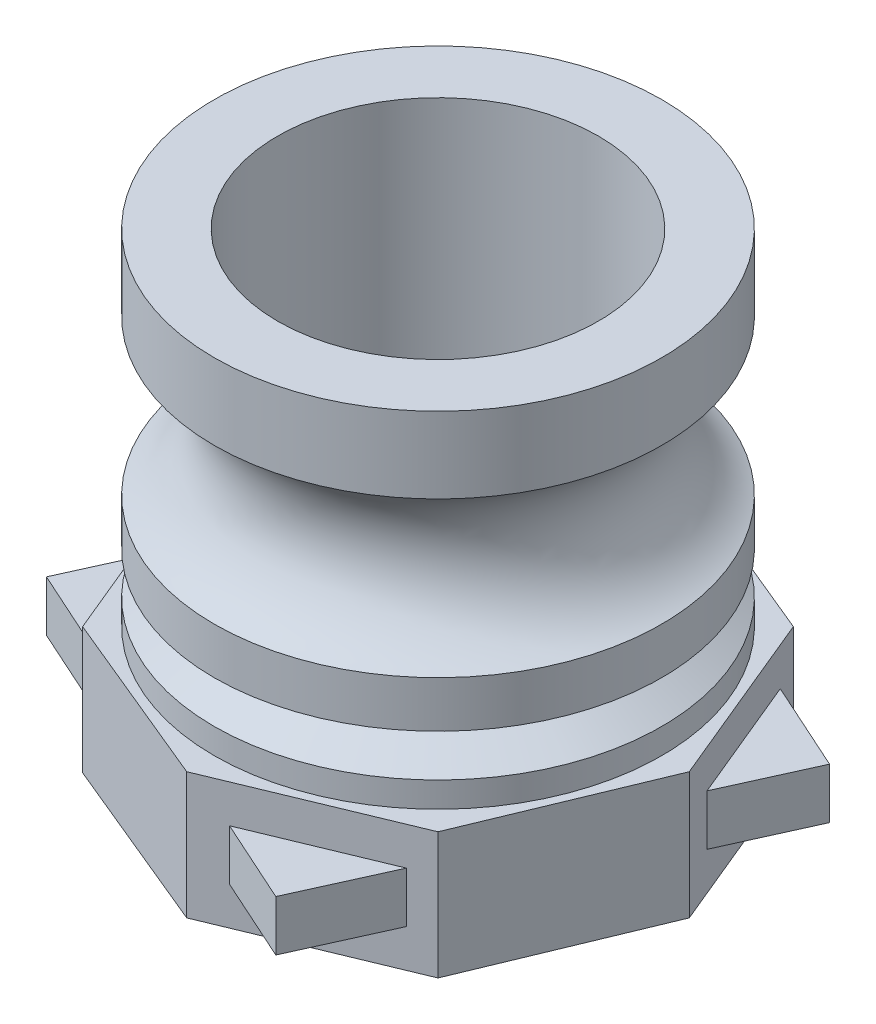
ISO-10303-21;
HEADER;
FILE_DESCRIPTION(('STEP AP214'),'2;1');
FILE_NAME('part.step','',(''),(''),'','','');
FILE_SCHEMA(('AUTOMOTIVE_DESIGN { 1 0 10303 214 1 1 1 1 }'));
ENDSEC;
DATA;
#1=APPLICATION_CONTEXT('core data for automotive mechanical design processes');
#2=APPLICATION_PROTOCOL_DEFINITION('international standard','automotive_design',2000,#1);
#3=PRODUCT_CONTEXT('',#1,'mechanical');
#4=PRODUCT('Part','Part','',(#3));
#5=PRODUCT_RELATED_PRODUCT_CATEGORY('part','',(#4));
#6=PRODUCT_DEFINITION_FORMATION('','',#4);
#7=PRODUCT_DEFINITION_CONTEXT('part definition',#1,'design');
#8=PRODUCT_DEFINITION('design','',#6,#7);
#9=PRODUCT_DEFINITION_SHAPE('','',#8);
#10=(LENGTH_UNIT() NAMED_UNIT(*) SI_UNIT(.MILLI.,.METRE.));
#11=(NAMED_UNIT(*) PLANE_ANGLE_UNIT() SI_UNIT($,.RADIAN.));
#12=(NAMED_UNIT(*) SI_UNIT($,.STERADIAN.) SOLID_ANGLE_UNIT());
#13=UNCERTAINTY_MEASURE_WITH_UNIT(LENGTH_MEASURE(1.E-05),#10,'distance_accuracy_value','');
#14=(GEOMETRIC_REPRESENTATION_CONTEXT(3) GLOBAL_UNCERTAINTY_ASSIGNED_CONTEXT((#13)) GLOBAL_UNIT_ASSIGNED_CONTEXT((#10,
#11,#12)) REPRESENTATION_CONTEXT('',''));
#15=CARTESIAN_POINT('',(0.,0.,0.));
#16=DIRECTION('',(0.,0.,1.));
#17=DIRECTION('',(1.,0.,0.));
#18=AXIS2_PLACEMENT_3D('',#15,#16,#17);
#19=CARTESIAN_POINT('',(0.,102.251774253954,0.));
#20=DIRECTION('',(0.,1.,0.));
#21=DIRECTION('',(0.,0.,1.));
#22=AXIS2_PLACEMENT_3D('',#19,#20,#21);
#23=CYLINDRICAL_SURFACE('',#22,26.5);
#24=CARTESIAN_POINT('',(0.,23.,0.));
#25=DIRECTION('',(0.,-1.,0.));
#26=DIRECTION('',(0.,0.,-1.));
#27=AXIS2_PLACEMENT_3D('',#24,#25,#26);
#28=CIRCLE('',#27,26.5);
#29=CARTESIAN_POINT('',(0.,23.,-26.5));
#30=VERTEX_POINT('',#29);
#31=EDGE_CURVE('E257',#30,#30,#28,.T.);
#32=ORIENTED_EDGE('',*,*,#31,.F.);
#33=EDGE_LOOP('',(#32));
#34=FACE_BOUND('',#33,.T.);
#35=CARTESIAN_POINT('',(0.,28.5,0.));
#36=DIRECTION('',(0.,1.,0.));
#37=DIRECTION('',(0.,0.,1.));
#38=AXIS2_PLACEMENT_3D('',#35,#36,#37);
#39=CIRCLE('',#38,26.5);
#40=CARTESIAN_POINT('',(0.,28.5,26.5));
#41=VERTEX_POINT('',#40);
#42=EDGE_CURVE('E284',#41,#41,#39,.T.);
#43=ORIENTED_EDGE('',*,*,#42,.F.);
#44=EDGE_LOOP('',(#43));
#45=FACE_BOUND('',#44,.T.);
#46=ADVANCED_FACE('F41',(#34,#45),#23,.T.);
#47=CARTESIAN_POINT('',(0.,15.,0.));
#48=DIRECTION('',(0.,1.,0.));
#49=DIRECTION('',(0.,0.,1.));
#50=AXIS2_PLACEMENT_3D('',#47,#48,#49);
#51=PLANE('',#50);
#52=CARTESIAN_POINT('',(0.,15.,0.));
#53=DIRECTION('',(0.,1.,0.));
#54=DIRECTION('',(0.,0.,1.));
#55=AXIS2_PLACEMENT_3D('',#52,#53,#54);
#56=CIRCLE('',#55,26.5);
#57=CARTESIAN_POINT('',(0.,15.,26.5));
#58=VERTEX_POINT('',#57);
#59=EDGE_CURVE('E11',#58,#58,#56,.T.);
#60=ORIENTED_EDGE('',*,*,#59,.F.);
#61=EDGE_LOOP('',(#60));
#62=FACE_BOUND('',#61,.T.);
#63=DIRECTION('',(-0.382683432365091,0.,-0.923879532511286));
#64=VECTOR('',#63,1.);
#65=CARTESIAN_POINT('',(29.7657855080408,15.,0.));
#66=LINE('',#65,#64);
#67=CARTESIAN_POINT('',(29.7657855080408,15.,0.));
#68=VERTEX_POINT('',#67);
#69=CARTESIAN_POINT('',(21.0475887800799,15.,-21.04758878008));
#70=VERTEX_POINT('',#69);
#71=EDGE_CURVE('E297',#68,#70,#66,.T.);
#72=ORIENTED_EDGE('',*,*,#71,.T.);
#73=DIRECTION('',(-0.923879532511287,0.,-0.382683432365089));
#74=VECTOR('',#73,1.);
#75=CARTESIAN_POINT('',(21.0475887800799,15.,-21.04758878008));
#76=LINE('',#75,#74);
#77=CARTESIAN_POINT('',(0.,15.,-29.7657855080408));
#78=VERTEX_POINT('',#77);
#79=EDGE_CURVE('E300',#70,#78,#76,.T.);
#80=ORIENTED_EDGE('',*,*,#79,.T.);
#81=DIRECTION('',(-0.923879532511286,0.,0.382683432365091));
#82=VECTOR('',#81,1.);
#83=CARTESIAN_POINT('',(0.,15.,-29.7657855080408));
#84=LINE('',#83,#82);
#85=CARTESIAN_POINT('',(-21.04758878008,15.,-21.0475887800799));
#86=VERTEX_POINT('',#85);
#87=EDGE_CURVE('E303',#78,#86,#84,.T.);
#88=ORIENTED_EDGE('',*,*,#87,.T.);
#89=DIRECTION('',(-0.382683432365089,0.,0.923879532511287));
#90=VECTOR('',#89,1.);
#91=CARTESIAN_POINT('',(-21.04758878008,15.,-21.0475887800799));
#92=LINE('',#91,#90);
#93=CARTESIAN_POINT('',(-29.7657855080408,15.,0.));
#94=VERTEX_POINT('',#93);
#95=EDGE_CURVE('E305',#86,#94,#92,.T.);
#96=ORIENTED_EDGE('',*,*,#95,.T.);
#97=DIRECTION('',(0.382683432365091,0.,0.923879532511287));
#98=VECTOR('',#97,1.);
#99=CARTESIAN_POINT('',(-29.7657855080408,15.,0.));
#100=LINE('',#99,#98);
#101=CARTESIAN_POINT('',(-21.0475887800799,15.,21.04758878008));
#102=VERTEX_POINT('',#101);
#103=EDGE_CURVE('E307',#94,#102,#100,.T.);
#104=ORIENTED_EDGE('',*,*,#103,.T.);
#105=DIRECTION('',(0.923879532511287,0.,0.382683432365089));
#106=VECTOR('',#105,1.);
#107=CARTESIAN_POINT('',(-21.0475887800799,15.,21.04758878008));
#108=LINE('',#107,#106);
#109=CARTESIAN_POINT('',(0.,15.,29.7657855080408));
#110=VERTEX_POINT('',#109);
#111=EDGE_CURVE('E309',#102,#110,#108,.T.);
#112=ORIENTED_EDGE('',*,*,#111,.T.);
#113=DIRECTION('',(0.923879532511286,0.,-0.382683432365091));
#114=VECTOR('',#113,1.);
#115=CARTESIAN_POINT('',(0.,15.,29.7657855080408));
#116=LINE('',#115,#114);
#117=CARTESIAN_POINT('',(21.04758878008,15.,21.0475887800799));
#118=VERTEX_POINT('',#117);
#119=EDGE_CURVE('E311',#110,#118,#116,.T.);
#120=ORIENTED_EDGE('',*,*,#119,.T.);
#121=DIRECTION('',(0.382683432365089,0.,-0.923879532511287));
#122=VECTOR('',#121,1.);
#123=CARTESIAN_POINT('',(21.04758878008,15.,21.0475887800799));
#124=LINE('',#123,#122);
#125=EDGE_CURVE('E313',#118,#68,#124,.T.);
#126=ORIENTED_EDGE('',*,*,#125,.T.);
#127=EDGE_LOOP('',(#72,#80,#88,#96,#104,#112,#120,#126));
#128=FACE_BOUND('',#127,.T.);
#129=ADVANCED_FACE('F374',(#62,#128),#51,.T.);
#130=CARTESIAN_POINT('',(0.,0.,0.));
#131=DIRECTION('',(0.,1.,0.));
#132=DIRECTION('',(0.,0.,1.));
#133=AXIS2_PLACEMENT_3D('',#130,#131,#132);
#134=PLANE('',#133);
#135=DIRECTION('',(-0.382683432365091,0.,-0.923879532511286));
#136=VECTOR('',#135,1.);
#137=CARTESIAN_POINT('',(29.7657855080408,0.,0.));
#138=LINE('',#137,#136);
#139=CARTESIAN_POINT('',(29.7657855080408,0.,0.));
#140=VERTEX_POINT('',#139);
#141=CARTESIAN_POINT('',(21.0475887800799,0.,-21.04758878008));
#142=VERTEX_POINT('',#141);
#143=EDGE_CURVE('E296',#140,#142,#138,.T.);
#144=ORIENTED_EDGE('',*,*,#143,.F.);
#145=DIRECTION('',(0.382683432365089,0.,-0.923879532511287));
#146=VECTOR('',#145,1.);
#147=CARTESIAN_POINT('',(21.04758878008,0.,21.0475887800799));
#148=LINE('',#147,#146);
#149=CARTESIAN_POINT('',(21.04758878008,0.,21.0475887800799));
#150=VERTEX_POINT('',#149);
#151=EDGE_CURVE('E301',#150,#140,#148,.T.);
#152=ORIENTED_EDGE('',*,*,#151,.F.);
#153=DIRECTION('',(0.923879532511286,0.,-0.382683432365091));
#154=VECTOR('',#153,1.);
#155=CARTESIAN_POINT('',(0.,0.,29.7657855080408));
#156=LINE('',#155,#154);
#157=CARTESIAN_POINT('',(0.,0.,29.7657855080408));
#158=VERTEX_POINT('',#157);
#159=EDGE_CURVE('E328',#158,#150,#156,.T.);
#160=ORIENTED_EDGE('',*,*,#159,.F.);
#161=DIRECTION('',(0.923879532511287,0.,0.382683432365089));
#162=VECTOR('',#161,1.);
#163=CARTESIAN_POINT('',(-21.0475887800799,0.,21.04758878008));
#164=LINE('',#163,#162);
#165=CARTESIAN_POINT('',(-21.0475887800799,0.,21.04758878008));
#166=VERTEX_POINT('',#165);
#167=EDGE_CURVE('E326',#166,#158,#164,.T.);
#168=ORIENTED_EDGE('',*,*,#167,.F.);
#169=DIRECTION('',(0.382683432365091,0.,0.923879532511287));
#170=VECTOR('',#169,1.);
#171=CARTESIAN_POINT('',(-29.7657855080408,0.,0.));
#172=LINE('',#171,#170);
#173=CARTESIAN_POINT('',(-29.7657855080408,0.,0.));
#174=VERTEX_POINT('',#173);
#175=EDGE_CURVE('E324',#174,#166,#172,.T.);
#176=ORIENTED_EDGE('',*,*,#175,.F.);
#177=DIRECTION('',(-0.382683432365089,0.,0.923879532511287));
#178=VECTOR('',#177,1.);
#179=CARTESIAN_POINT('',(-21.04758878008,0.,-21.0475887800799));
#180=LINE('',#179,#178);
#181=CARTESIAN_POINT('',(-21.04758878008,0.,-21.0475887800799));
#182=VERTEX_POINT('',#181);
#183=EDGE_CURVE('E322',#182,#174,#180,.T.);
#184=ORIENTED_EDGE('',*,*,#183,.F.);
#185=DIRECTION('',(-0.923879532511286,0.,0.382683432365091));
#186=VECTOR('',#185,1.);
#187=CARTESIAN_POINT('',(0.,0.,-29.7657855080408));
#188=LINE('',#187,#186);
#189=CARTESIAN_POINT('',(0.,0.,-29.7657855080408));
#190=VERTEX_POINT('',#189);
#191=EDGE_CURVE('E320',#190,#182,#188,.T.);
#192=ORIENTED_EDGE('',*,*,#191,.F.);
#193=DIRECTION('',(-0.923879532511287,0.,-0.382683432365089));
#194=VECTOR('',#193,1.);
#195=CARTESIAN_POINT('',(21.0475887800799,0.,-21.04758878008));
#196=LINE('',#195,#194);
#197=EDGE_CURVE('E318',#142,#190,#196,.T.);
#198=ORIENTED_EDGE('',*,*,#197,.F.);
#199=EDGE_LOOP('',(#144,#152,#160,#168,#176,#184,#192,#198));
#200=FACE_BOUND('',#199,.T.);
#201=CARTESIAN_POINT('',(0.,0.,0.));
#202=DIRECTION('',(0.,1.,0.));
#203=DIRECTION('',(0.,0.,1.));
#204=AXIS2_PLACEMENT_3D('',#201,#202,#203);
#205=CIRCLE('',#204,19.);
#206=CARTESIAN_POINT('',(0.,0.,19.));
#207=VERTEX_POINT('',#206);
#208=EDGE_CURVE('E292',#207,#207,#205,.T.);
#209=ORIENTED_EDGE('',*,*,#208,.T.);
#210=EDGE_LOOP('',(#209));
#211=FACE_BOUND('',#210,.T.);
#212=ADVANCED_FACE('F362',(#200,#211),#134,.F.);
#213=CARTESIAN_POINT('',(29.7657855080408,15.,0.));
#214=DIRECTION('',(-0.923879532511286,0.,0.382683432365091));
#215=DIRECTION('',(0.382683432365091,0.,0.923879532511287));
#216=AXIS2_PLACEMENT_3D('',#213,#214,#215);
#217=PLANE('',#216);
#218=DIRECTION('',(0.,-1.,0.));
#219=VECTOR('',#218,1.);
#220=CARTESIAN_POINT('',(22.1455628553143,10.5,-18.3968448765151));
#221=LINE('',#220,#219);
#222=CARTESIAN_POINT('',(22.1455628553143,10.5,-18.3968448765151));
#223=VERTEX_POINT('',#222);
#224=CARTESIAN_POINT('',(22.1455628553143,4.5,-18.3968448765151));
#225=VERTEX_POINT('',#224);
#226=EDGE_CURVE('E278',#223,#225,#221,.T.);
#227=ORIENTED_EDGE('',*,*,#226,.T.);
#228=DIRECTION('',(0.382683432365091,0.,0.923879532511286));
#229=VECTOR('',#228,1.);
#230=CARTESIAN_POINT('',(22.1455628553143,4.5,-18.3968448765151));
#231=LINE('',#230,#229);
#232=CARTESIAN_POINT('',(28.2807214255426,4.5,-3.58526184896049));
#233=VERTEX_POINT('',#232);
#234=EDGE_CURVE('E270',#225,#233,#231,.T.);
#235=ORIENTED_EDGE('',*,*,#234,.T.);
#236=DIRECTION('',(0.,-1.,0.));
#237=VECTOR('',#236,1.);
#238=CARTESIAN_POINT('',(28.2807214255426,10.5,-3.58526184896049));
#239=LINE('',#238,#237);
#240=CARTESIAN_POINT('',(28.2807214255426,10.5,-3.58526184896049));
#241=VERTEX_POINT('',#240);
#242=EDGE_CURVE('E276',#241,#233,#239,.T.);
#243=ORIENTED_EDGE('',*,*,#242,.F.);
#244=DIRECTION('',(0.382683432365091,0.,0.923879532511286));
#245=VECTOR('',#244,1.);
#246=CARTESIAN_POINT('',(22.1455628553143,10.5,-18.3968448765151));
#247=LINE('',#246,#245);
#248=EDGE_CURVE('E263',#223,#241,#247,.T.);
#249=ORIENTED_EDGE('',*,*,#248,.F.);
#250=EDGE_LOOP('',(#227,#235,#243,#249));
#251=FACE_BOUND('',#250,.T.);
#252=ORIENTED_EDGE('',*,*,#143,.T.);
#253=DIRECTION('',(0.,-1.,0.));
#254=VECTOR('',#253,1.);
#255=CARTESIAN_POINT('',(21.0475887800799,15.,-21.04758878008));
#256=LINE('',#255,#254);
#257=EDGE_CURVE('E45',#70,#142,#256,.T.);
#258=ORIENTED_EDGE('',*,*,#257,.F.);
#259=ORIENTED_EDGE('',*,*,#71,.F.);
#260=DIRECTION('',(0.,-1.,0.));
#261=VECTOR('',#260,1.);
#262=CARTESIAN_POINT('',(29.7657855080408,15.,0.));
#263=LINE('',#262,#261);
#264=EDGE_CURVE('E315',#68,#140,#263,.T.);
#265=ORIENTED_EDGE('',*,*,#264,.T.);
#266=EDGE_LOOP('',(#252,#258,#259,#265));
#267=FACE_BOUND('',#266,.T.);
#268=ADVANCED_FACE('F43',(#251,#267),#217,.F.);
#269=CARTESIAN_POINT('',(21.0475887800799,15.,-21.04758878008));
#270=DIRECTION('',(-0.382683432365089,0.,0.923879532511287));
#271=DIRECTION('',(0.923879532511287,0.,0.382683432365089));
#272=AXIS2_PLACEMENT_3D('',#269,#270,#271);
#273=PLANE('',#272);
#274=ORIENTED_EDGE('',*,*,#197,.T.);
#275=DIRECTION('',(0.,-1.,0.));
#276=VECTOR('',#275,1.);
#277=CARTESIAN_POINT('',(0.,15.,-29.7657855080408));
#278=LINE('',#277,#276);
#279=EDGE_CURVE('E347',#78,#190,#278,.T.);
#280=ORIENTED_EDGE('',*,*,#279,.F.);
#281=ORIENTED_EDGE('',*,*,#79,.F.);
#282=ORIENTED_EDGE('',*,*,#257,.T.);
#283=EDGE_LOOP('',(#274,#280,#281,#282));
#284=FACE_BOUND('',#283,.T.);
#285=ADVANCED_FACE('F355',(#284),#273,.F.);
#286=CARTESIAN_POINT('',(0.,15.,-29.7657855080408));
#287=DIRECTION('',(0.382683432365091,0.,0.923879532511287));
#288=DIRECTION('',(0.923879532511287,0.,-0.382683432365091));
#289=AXIS2_PLACEMENT_3D('',#286,#287,#288);
#290=PLANE('',#289);
#291=DIRECTION('',(0.,-1.,0.));
#292=VECTOR('',#291,1.);
#293=CARTESIAN_POINT('',(-18.3968448765149,10.5,-22.1455628553145));
#294=LINE('',#293,#292);
#295=CARTESIAN_POINT('',(-18.3968448765149,10.5,-22.1455628553145));
#296=VERTEX_POINT('',#295);
#297=CARTESIAN_POINT('',(-18.3968448765149,4.5,-22.1455628553145));
#298=VERTEX_POINT('',#297);
#299=EDGE_CURVE('E192',#296,#298,#294,.T.);
#300=ORIENTED_EDGE('',*,*,#299,.T.);
#301=DIRECTION('',(0.92387953251129,0.,-0.382683432365081));
#302=VECTOR('',#301,1.);
#303=CARTESIAN_POINT('',(-18.3968448765149,4.5,-22.1455628553145));
#304=LINE('',#303,#302);
#305=CARTESIAN_POINT('',(-3.58526184896019,4.5,-28.2807214255426));
#306=VERTEX_POINT('',#305);
#307=EDGE_CURVE('E206',#298,#306,#304,.T.);
#308=ORIENTED_EDGE('',*,*,#307,.T.);
#309=DIRECTION('',(0.,-1.,0.));
#310=VECTOR('',#309,1.);
#311=CARTESIAN_POINT('',(-3.58526184896019,10.5,-28.2807214255426));
#312=LINE('',#311,#310);
#313=CARTESIAN_POINT('',(-3.58526184896019,10.5,-28.2807214255426));
#314=VERTEX_POINT('',#313);
#315=EDGE_CURVE('E196',#314,#306,#312,.T.);
#316=ORIENTED_EDGE('',*,*,#315,.F.);
#317=DIRECTION('',(0.92387953251129,0.,-0.382683432365081));
#318=VECTOR('',#317,1.);
#319=CARTESIAN_POINT('',(-18.3968448765149,10.5,-22.1455628553145));
#320=LINE('',#319,#318);
#321=EDGE_CURVE('E185',#296,#314,#320,.T.);
#322=ORIENTED_EDGE('',*,*,#321,.F.);
#323=EDGE_LOOP('',(#300,#308,#316,#322));
#324=FACE_BOUND('',#323,.T.);
#325=ORIENTED_EDGE('',*,*,#191,.T.);
#326=DIRECTION('',(0.,-1.,0.));
#327=VECTOR('',#326,1.);
#328=CARTESIAN_POINT('',(-21.04758878008,15.,-21.0475887800799));
#329=LINE('',#328,#327);
#330=EDGE_CURVE('E345',#86,#182,#329,.T.);
#331=ORIENTED_EDGE('',*,*,#330,.F.);
#332=ORIENTED_EDGE('',*,*,#87,.F.);
#333=ORIENTED_EDGE('',*,*,#279,.T.);
#334=EDGE_LOOP('',(#325,#331,#332,#333));
#335=FACE_BOUND('',#334,.T.);
#336=ADVANCED_FACE('F199',(#324,#335),#290,.F.);
#337=CARTESIAN_POINT('',(-21.04758878008,15.,-21.0475887800799));
#338=DIRECTION('',(0.923879532511287,0.,0.382683432365089));
#339=DIRECTION('',(0.382683432365089,0.,-0.923879532511287));
#340=AXIS2_PLACEMENT_3D('',#337,#338,#339);
#341=PLANE('',#340);
#342=ORIENTED_EDGE('',*,*,#183,.T.);
#343=DIRECTION('',(0.,-1.,0.));
#344=VECTOR('',#343,1.);
#345=CARTESIAN_POINT('',(-29.7657855080408,15.,0.));
#346=LINE('',#345,#344);
#347=EDGE_CURVE('E342',#94,#174,#346,.T.);
#348=ORIENTED_EDGE('',*,*,#347,.F.);
#349=ORIENTED_EDGE('',*,*,#95,.F.);
#350=ORIENTED_EDGE('',*,*,#330,.T.);
#351=EDGE_LOOP('',(#342,#348,#349,#350));
#352=FACE_BOUND('',#351,.T.);
#353=ADVANCED_FACE('F370',(#352),#341,.F.);
#354=CARTESIAN_POINT('',(-29.7657855080408,15.,0.));
#355=DIRECTION('',(0.923879532511286,0.,-0.38268343236509));
#356=DIRECTION('',(-0.382683432365091,0.,-0.923879532511287));
#357=AXIS2_PLACEMENT_3D('',#354,#355,#356);
#358=PLANE('',#357);
#359=DIRECTION('',(0.,-1.,0.));
#360=VECTOR('',#359,1.);
#361=CARTESIAN_POINT('',(-22.1455628553143,10.5,18.3968448765151));
#362=LINE('',#361,#360);
#363=CARTESIAN_POINT('',(-22.1455628553143,10.5,18.3968448765151));
#364=VERTEX_POINT('',#363);
#365=CARTESIAN_POINT('',(-22.1455628553143,4.5,18.3968448765151));
#366=VERTEX_POINT('',#365);
#367=EDGE_CURVE('E227',#364,#366,#362,.T.);
#368=ORIENTED_EDGE('',*,*,#367,.T.);
#369=DIRECTION('',(-0.382683432365091,0.,-0.923879532511286));
#370=VECTOR('',#369,1.);
#371=CARTESIAN_POINT('',(-22.1455628553143,4.5,18.3968448765151));
#372=LINE('',#371,#370);
#373=CARTESIAN_POINT('',(-28.2807214255426,4.5,3.58526184896049));
#374=VERTEX_POINT('',#373);
#375=EDGE_CURVE('E220',#366,#374,#372,.T.);
#376=ORIENTED_EDGE('',*,*,#375,.T.);
#377=DIRECTION('',(0.,-1.,0.));
#378=VECTOR('',#377,1.);
#379=CARTESIAN_POINT('',(-28.2807214255426,10.5,3.58526184896049));
#380=LINE('',#379,#378);
#381=CARTESIAN_POINT('',(-28.2807214255426,10.5,3.58526184896049));
#382=VERTEX_POINT('',#381);
#383=EDGE_CURVE('E225',#382,#374,#380,.T.);
#384=ORIENTED_EDGE('',*,*,#383,.F.);
#385=DIRECTION('',(-0.382683432365091,0.,-0.923879532511286));
#386=VECTOR('',#385,1.);
#387=CARTESIAN_POINT('',(-22.1455628553143,10.5,18.3968448765151));
#388=LINE('',#387,#386);
#389=EDGE_CURVE('E213',#364,#382,#388,.T.);
#390=ORIENTED_EDGE('',*,*,#389,.F.);
#391=EDGE_LOOP('',(#368,#376,#384,#390));
#392=FACE_BOUND('',#391,.T.);
#393=ORIENTED_EDGE('',*,*,#175,.T.);
#394=DIRECTION('',(0.,-1.,0.));
#395=VECTOR('',#394,1.);
#396=CARTESIAN_POINT('',(-21.0475887800799,15.,21.04758878008));
#397=LINE('',#396,#395);
#398=EDGE_CURVE('E339',#102,#166,#397,.T.);
#399=ORIENTED_EDGE('',*,*,#398,.F.);
#400=ORIENTED_EDGE('',*,*,#103,.F.);
#401=ORIENTED_EDGE('',*,*,#347,.T.);
#402=EDGE_LOOP('',(#393,#399,#400,#401));
#403=FACE_BOUND('',#402,.T.);
#404=ADVANCED_FACE('F389',(#392,#403),#358,.F.);
#405=CARTESIAN_POINT('',(-21.0475887800799,15.,21.04758878008));
#406=DIRECTION('',(0.382683432365089,0.,-0.923879532511287));
#407=DIRECTION('',(-0.923879532511287,0.,-0.382683432365089));
#408=AXIS2_PLACEMENT_3D('',#405,#406,#407);
#409=PLANE('',#408);
#410=ORIENTED_EDGE('',*,*,#167,.T.);
#411=DIRECTION('',(0.,-1.,0.));
#412=VECTOR('',#411,1.);
#413=CARTESIAN_POINT('',(0.,15.,29.7657855080408));
#414=LINE('',#413,#412);
#415=EDGE_CURVE('E336',#110,#158,#414,.T.);
#416=ORIENTED_EDGE('',*,*,#415,.F.);
#417=ORIENTED_EDGE('',*,*,#111,.F.);
#418=ORIENTED_EDGE('',*,*,#398,.T.);
#419=EDGE_LOOP('',(#410,#416,#417,#418));
#420=FACE_BOUND('',#419,.T.);
#421=ADVANCED_FACE('F386',(#420),#409,.F.);
#422=CARTESIAN_POINT('',(0.,15.,29.7657855080408));
#423=DIRECTION('',(-0.382683432365091,0.,-0.923879532511286));
#424=DIRECTION('',(-0.923879532511287,0.,0.382683432365091));
#425=AXIS2_PLACEMENT_3D('',#422,#423,#424);
#426=PLANE('',#425);
#427=DIRECTION('',(0.,-1.,0.));
#428=VECTOR('',#427,1.);
#429=CARTESIAN_POINT('',(18.396844876515,10.5,22.1455628553144));
#430=LINE('',#429,#428);
#431=CARTESIAN_POINT('',(18.396844876515,10.5,22.1455628553144));
#432=VERTEX_POINT('',#431);
#433=CARTESIAN_POINT('',(18.396844876515,4.5,22.1455628553144));
#434=VERTEX_POINT('',#433);
#435=EDGE_CURVE('E248',#432,#434,#430,.T.);
#436=ORIENTED_EDGE('',*,*,#435,.T.);
#437=DIRECTION('',(-0.923879532511288,0.,0.382683432365087));
#438=VECTOR('',#437,1.);
#439=CARTESIAN_POINT('',(18.396844876515,4.5,22.1455628553144));
#440=LINE('',#439,#438);
#441=CARTESIAN_POINT('',(3.58526184896039,4.5,28.2807214255426));
#442=VERTEX_POINT('',#441);
#443=EDGE_CURVE('E240',#434,#442,#440,.T.);
#444=ORIENTED_EDGE('',*,*,#443,.T.);
#445=DIRECTION('',(0.,-1.,0.));
#446=VECTOR('',#445,1.);
#447=CARTESIAN_POINT('',(3.58526184896039,10.5,28.2807214255426));
#448=LINE('',#447,#446);
#449=CARTESIAN_POINT('',(3.58526184896039,10.5,28.2807214255426));
#450=VERTEX_POINT('',#449);
#451=EDGE_CURVE('E246',#450,#442,#448,.T.);
#452=ORIENTED_EDGE('',*,*,#451,.F.);
#453=DIRECTION('',(-0.923879532511288,0.,0.382683432365087));
#454=VECTOR('',#453,1.);
#455=CARTESIAN_POINT('',(18.396844876515,10.5,22.1455628553144));
#456=LINE('',#455,#454);
#457=EDGE_CURVE('E233',#432,#450,#456,.T.);
#458=ORIENTED_EDGE('',*,*,#457,.F.);
#459=EDGE_LOOP('',(#436,#444,#452,#458));
#460=FACE_BOUND('',#459,.T.);
#461=ORIENTED_EDGE('',*,*,#159,.T.);
#462=DIRECTION('',(0.,-1.,0.));
#463=VECTOR('',#462,1.);
#464=CARTESIAN_POINT('',(21.04758878008,15.,21.0475887800799));
#465=LINE('',#464,#463);
#466=EDGE_CURVE('E333',#118,#150,#465,.T.);
#467=ORIENTED_EDGE('',*,*,#466,.F.);
#468=ORIENTED_EDGE('',*,*,#119,.F.);
#469=ORIENTED_EDGE('',*,*,#415,.T.);
#470=EDGE_LOOP('',(#461,#467,#468,#469));
#471=FACE_BOUND('',#470,.T.);
#472=ADVANCED_FACE('F382',(#460,#471),#426,.F.);
#473=CARTESIAN_POINT('',(21.04758878008,15.,21.0475887800799));
#474=DIRECTION('',(-0.923879532511287,0.,-0.382683432365089));
#475=DIRECTION('',(-0.382683432365089,0.,0.923879532511287));
#476=AXIS2_PLACEMENT_3D('',#473,#474,#475);
#477=PLANE('',#476);
#478=ORIENTED_EDGE('',*,*,#151,.T.);
#479=ORIENTED_EDGE('',*,*,#264,.F.);
#480=ORIENTED_EDGE('',*,*,#125,.F.);
#481=ORIENTED_EDGE('',*,*,#466,.T.);
#482=EDGE_LOOP('',(#478,#479,#480,#481));
#483=FACE_BOUND('',#482,.T.);
#484=ADVANCED_FACE('F380',(#483),#477,.F.);
#485=CARTESIAN_POINT('',(0.,15.,0.));
#486=DIRECTION('',(0.,-1.,0.));
#487=DIRECTION('',(0.,0.,-1.));
#488=AXIS2_PLACEMENT_3D('',#485,#486,#487);
#489=CYLINDRICAL_SURFACE('',#488,19.);
#490=ORIENTED_EDGE('',*,*,#208,.F.);
#491=EDGE_LOOP('',(#490));
#492=FACE_BOUND('',#491,.T.);
#493=CARTESIAN_POINT('',(0.,55.8303027798234,0.));
#494=DIRECTION('',(0.,1.,0.));
#495=DIRECTION('',(0.,0.,1.));
#496=AXIS2_PLACEMENT_3D('',#493,#494,#495);
#497=CIRCLE('',#496,19.);
#498=CARTESIAN_POINT('',(0.,55.8303027798234,19.));
#499=VERTEX_POINT('',#498);
#500=EDGE_CURVE('E281',#499,#499,#497,.T.);
#501=ORIENTED_EDGE('',*,*,#500,.T.);
#502=EDGE_LOOP('',(#501));
#503=FACE_BOUND('',#502,.T.);
#504=ADVANCED_FACE('F458',(#492,#503),#489,.F.);
#505=CARTESIAN_POINT('',(0.,37.6651513899117,0.));
#506=DIRECTION('',(0.,1.,0.));
#507=DIRECTION('',(0.,0.,1.));
#508=AXIS2_PLACEMENT_3D('',#505,#506,#507);
#509=TOROIDAL_SURFACE('',#508,30.5,10.);
#510=CARTESIAN_POINT('',(0.,46.8303027798234,0.));
#511=DIRECTION('',(0.,1.,0.));
#512=DIRECTION('',(0.,0.,1.));
#513=AXIS2_PLACEMENT_3D('',#510,#511,#512);
#514=CIRCLE('',#513,26.5);
#515=CARTESIAN_POINT('',(0.,46.8303027798234,26.5));
#516=VERTEX_POINT('',#515);
#517=EDGE_CURVE('E287',#516,#516,#514,.T.);
#518=ORIENTED_EDGE('',*,*,#517,.F.);
#519=EDGE_LOOP('',(#518));
#520=FACE_BOUND('',#519,.T.);
#521=ORIENTED_EDGE('',*,*,#42,.T.);
#522=EDGE_LOOP('',(#521));
#523=FACE_BOUND('',#522,.T.);
#524=ADVANCED_FACE('F455',(#520,#523),#509,.F.);
#525=CARTESIAN_POINT('',(0.,102.251774253954,0.));
#526=DIRECTION('',(0.,1.,0.));
#527=DIRECTION('',(0.,0.,1.));
#528=AXIS2_PLACEMENT_3D('',#525,#526,#527);
#529=CYLINDRICAL_SURFACE('',#528,26.5);
#530=CARTESIAN_POINT('',(0.,55.8303027798234,0.));
#531=DIRECTION('',(0.,1.,0.));
#532=DIRECTION('',(0.,0.,1.));
#533=AXIS2_PLACEMENT_3D('',#530,#531,#532);
#534=CIRCLE('',#533,26.5);
#535=CARTESIAN_POINT('',(0.,55.8303027798234,26.5));
#536=VERTEX_POINT('',#535);
#537=EDGE_CURVE('E290',#536,#536,#534,.T.);
#538=ORIENTED_EDGE('',*,*,#537,.F.);
#539=EDGE_LOOP('',(#538));
#540=FACE_BOUND('',#539,.T.);
#541=ORIENTED_EDGE('',*,*,#517,.T.);
#542=EDGE_LOOP('',(#541));
#543=FACE_BOUND('',#542,.T.);
#544=ADVANCED_FACE('F423',(#540,#543),#529,.T.);
#545=CARTESIAN_POINT('',(26.5,55.8303027798234,0.));
#546=DIRECTION('',(0.,-1.,0.));
#547=DIRECTION('',(0.,0.,-1.));
#548=AXIS2_PLACEMENT_3D('',#545,#546,#547);
#549=PLANE('',#548);
#550=ORIENTED_EDGE('',*,*,#500,.F.);
#551=EDGE_LOOP('',(#550));
#552=FACE_BOUND('',#551,.T.);
#553=ORIENTED_EDGE('',*,*,#537,.T.);
#554=EDGE_LOOP('',(#553));
#555=FACE_BOUND('',#554,.T.);
#556=ADVANCED_FACE('F414',(#552,#555),#549,.F.);
#557=CARTESIAN_POINT('',(0.,18.,0.));
#558=DIRECTION('',(0.,-1.,0.));
#559=DIRECTION('',(0.,0.,-1.));
#560=AXIS2_PLACEMENT_3D('',#557,#558,#559);
#561=CIRCLE('',#560,26.5);
#562=CARTESIAN_POINT('',(0.,18.,-26.5));
#563=VERTEX_POINT('',#562);
#564=EDGE_CURVE('E251',#563,#563,#561,.T.);
#565=ORIENTED_EDGE('',*,*,#564,.T.);
#566=EDGE_LOOP('',(#565));
#567=FACE_BOUND('',#566,.T.);
#568=ORIENTED_EDGE('',*,*,#59,.T.);
#569=EDGE_LOOP('',(#568));
#570=FACE_BOUND('',#569,.T.);
#571=ADVANCED_FACE('F402',(#567,#570),#23,.T.);
#572=CARTESIAN_POINT('',(32.7977234041508,10.5,-13.5852618489605));
#573=DIRECTION('',(-0.411652799570628,0.,0.911340755483735));
#574=DIRECTION('',(0.911340755483735,0.,0.411652799570628));
#575=AXIS2_PLACEMENT_3D('',#572,#573,#574);
#576=PLANE('',#575);
#577=DIRECTION('',(-0.911340755483735,0.,-0.411652799570628));
#578=VECTOR('',#577,1.);
#579=CARTESIAN_POINT('',(32.7977234041508,4.5,-13.5852618489605));
#580=LINE('',#579,#578);
#581=CARTESIAN_POINT('',(32.7977234041508,4.5,-13.5852618489605));
#582=VERTEX_POINT('',#581);
#583=EDGE_CURVE('E260',#582,#225,#580,.T.);
#584=ORIENTED_EDGE('',*,*,#583,.T.);
#585=ORIENTED_EDGE('',*,*,#226,.F.);
#586=DIRECTION('',(-0.911340755483735,0.,-0.411652799570628));
#587=VECTOR('',#586,1.);
#588=CARTESIAN_POINT('',(32.7977234041508,10.5,-13.5852618489605));
#589=LINE('',#588,#587);
#590=CARTESIAN_POINT('',(32.7977234041508,10.5,-13.5852618489605));
#591=VERTEX_POINT('',#590);
#592=EDGE_CURVE('E261',#591,#223,#589,.T.);
#593=ORIENTED_EDGE('',*,*,#592,.F.);
#594=DIRECTION('',(0.,-1.,0.));
#595=VECTOR('',#594,1.);
#596=CARTESIAN_POINT('',(32.7977234041508,10.5,-13.5852618489605));
#597=LINE('',#596,#595);
#598=EDGE_CURVE('E268',#591,#582,#597,.T.);
#599=ORIENTED_EDGE('',*,*,#598,.T.);
#600=EDGE_LOOP('',(#584,#585,#593,#599));
#601=FACE_BOUND('',#600,.T.);
#602=ADVANCED_FACE('F413',(#601),#576,.F.);
#603=CARTESIAN_POINT('',(28.2807214255426,10.5,-3.58526184896049));
#604=DIRECTION('',(-0.911340755483733,0.,-0.411652799570631));
#605=DIRECTION('',(-0.411652799570631,0.,0.911340755483734));
#606=AXIS2_PLACEMENT_3D('',#603,#604,#605);
#607=PLANE('',#606);
#608=DIRECTION('',(0.411652799570631,0.,-0.911340755483733));
#609=VECTOR('',#608,1.);
#610=CARTESIAN_POINT('',(28.2807214255426,4.5,-3.58526184896049));
#611=LINE('',#610,#609);
#612=EDGE_CURVE('E264',#233,#582,#611,.T.);
#613=ORIENTED_EDGE('',*,*,#612,.T.);
#614=ORIENTED_EDGE('',*,*,#598,.F.);
#615=DIRECTION('',(0.411652799570631,0.,-0.911340755483733));
#616=VECTOR('',#615,1.);
#617=CARTESIAN_POINT('',(28.2807214255426,10.5,-3.58526184896049));
#618=LINE('',#617,#616);
#619=EDGE_CURVE('E266',#241,#591,#618,.T.);
#620=ORIENTED_EDGE('',*,*,#619,.F.);
#621=ORIENTED_EDGE('',*,*,#242,.T.);
#622=EDGE_LOOP('',(#613,#614,#620,#621));
#623=FACE_BOUND('',#622,.T.);
#624=ADVANCED_FACE('F420',(#623),#607,.F.);
#625=CARTESIAN_POINT('',(0.,10.5,0.));
#626=DIRECTION('',(0.,-1.,0.));
#627=DIRECTION('',(0.,0.,-1.));
#628=AXIS2_PLACEMENT_3D('',#625,#626,#627);
#629=PLANE('',#628);
#630=ORIENTED_EDGE('',*,*,#592,.T.);
#631=ORIENTED_EDGE('',*,*,#248,.T.);
#632=ORIENTED_EDGE('',*,*,#619,.T.);
#633=EDGE_LOOP('',(#630,#631,#632));
#634=FACE_BOUND('',#633,.T.);
#635=ADVANCED_FACE('F444',(#634),#629,.F.);
#636=CARTESIAN_POINT('',(0.,4.5,0.));
#637=DIRECTION('',(0.,-1.,0.));
#638=DIRECTION('',(0.,0.,-1.));
#639=AXIS2_PLACEMENT_3D('',#636,#637,#638);
#640=PLANE('',#639);
#641=ORIENTED_EDGE('',*,*,#583,.F.);
#642=ORIENTED_EDGE('',*,*,#612,.F.);
#643=ORIENTED_EDGE('',*,*,#234,.F.);
#644=EDGE_LOOP('',(#641,#642,#643));
#645=FACE_BOUND('',#644,.T.);
#646=ADVANCED_FACE('F439',(#645),#640,.T.);
#647=CARTESIAN_POINT('',(0.,23.,0.));
#648=DIRECTION('',(0.,1.,0.));
#649=DIRECTION('',(0.,0.,1.));
#650=AXIS2_PLACEMENT_3D('',#647,#648,#649);
#651=CONICAL_SURFACE('',#650,26.5,1.0471975511966);
#652=CARTESIAN_POINT('',(0.,20.5,0.));
#653=DIRECTION('',(0.,-1.,0.));
#654=DIRECTION('',(0.,0.,-1.));
#655=AXIS2_PLACEMENT_3D('',#652,#653,#654);
#656=CIRCLE('',#655,22.1698729810778);
#657=CARTESIAN_POINT('',(0.,20.5,-22.1698729810778));
#658=VERTEX_POINT('',#657);
#659=EDGE_CURVE('E254',#658,#658,#656,.T.);
#660=ORIENTED_EDGE('',*,*,#659,.F.);
#661=EDGE_LOOP('',(#660));
#662=FACE_BOUND('',#661,.T.);
#663=ORIENTED_EDGE('',*,*,#31,.T.);
#664=EDGE_LOOP('',(#663));
#665=FACE_BOUND('',#664,.T.);
#666=ADVANCED_FACE('F433',(#662,#665),#651,.T.);
#667=CARTESIAN_POINT('',(0.,20.5,0.));
#668=DIRECTION('',(0.,-1.,0.));
#669=DIRECTION('',(0.,0.,-1.));
#670=AXIS2_PLACEMENT_3D('',#667,#668,#669);
#671=CONICAL_SURFACE('',#670,22.1698729810778,1.0471975511966);
#672=ORIENTED_EDGE('',*,*,#564,.F.);
#673=EDGE_LOOP('',(#672));
#674=FACE_BOUND('',#673,.T.);
#675=ORIENTED_EDGE('',*,*,#659,.T.);
#676=EDGE_LOOP('',(#675));
#677=FACE_BOUND('',#676,.T.);
#678=ADVANCED_FACE('F429',(#674,#677),#671,.T.);
#679=CARTESIAN_POINT('',(13.5852618489604,10.5,32.7977234041508));
#680=DIRECTION('',(-0.911340755483733,0.,-0.411652799570631));
#681=DIRECTION('',(-0.411652799570631,0.,0.911340755483734));
#682=AXIS2_PLACEMENT_3D('',#679,#680,#681);
#683=PLANE('',#682);
#684=DIRECTION('',(0.411652799570631,0.,-0.911340755483734));
#685=VECTOR('',#684,1.);
#686=CARTESIAN_POINT('',(13.5852618489604,4.5,32.7977234041508));
#687=LINE('',#686,#685);
#688=CARTESIAN_POINT('',(13.5852618489604,4.5,32.7977234041508));
#689=VERTEX_POINT('',#688);
#690=EDGE_CURVE('E230',#689,#434,#687,.T.);
#691=ORIENTED_EDGE('',*,*,#690,.T.);
#692=ORIENTED_EDGE('',*,*,#435,.F.);
#693=DIRECTION('',(0.411652799570631,0.,-0.911340755483734));
#694=VECTOR('',#693,1.);
#695=CARTESIAN_POINT('',(13.5852618489604,10.5,32.7977234041508));
#696=LINE('',#695,#694);
#697=CARTESIAN_POINT('',(13.5852618489604,10.5,32.7977234041508));
#698=VERTEX_POINT('',#697);
#699=EDGE_CURVE('E231',#698,#432,#696,.T.);
#700=ORIENTED_EDGE('',*,*,#699,.F.);
#701=DIRECTION('',(0.,-1.,0.));
#702=VECTOR('',#701,1.);
#703=CARTESIAN_POINT('',(13.5852618489604,10.5,32.7977234041508));
#704=LINE('',#703,#702);
#705=EDGE_CURVE('E238',#698,#689,#704,.T.);
#706=ORIENTED_EDGE('',*,*,#705,.T.);
#707=EDGE_LOOP('',(#691,#692,#700,#706));
#708=FACE_BOUND('',#707,.T.);
#709=ADVANCED_FACE('F432',(#708),#683,.F.);
#710=CARTESIAN_POINT('',(3.58526184896039,10.5,28.2807214255426));
#711=DIRECTION('',(0.411652799570634,0.,-0.911340755483732));
#712=DIRECTION('',(-0.911340755483732,0.,-0.411652799570634));
#713=AXIS2_PLACEMENT_3D('',#710,#711,#712);
#714=PLANE('',#713);
#715=DIRECTION('',(0.911340755483732,0.,0.411652799570634));
#716=VECTOR('',#715,1.);
#717=CARTESIAN_POINT('',(3.58526184896039,4.5,28.2807214255426));
#718=LINE('',#717,#716);
#719=EDGE_CURVE('E234',#442,#689,#718,.T.);
#720=ORIENTED_EDGE('',*,*,#719,.T.);
#721=ORIENTED_EDGE('',*,*,#705,.F.);
#722=DIRECTION('',(0.911340755483732,0.,0.411652799570634));
#723=VECTOR('',#722,1.);
#724=CARTESIAN_POINT('',(3.58526184896039,10.5,28.2807214255426));
#725=LINE('',#724,#723);
#726=EDGE_CURVE('E236',#450,#698,#725,.T.);
#727=ORIENTED_EDGE('',*,*,#726,.F.);
#728=ORIENTED_EDGE('',*,*,#451,.T.);
#729=EDGE_LOOP('',(#720,#721,#727,#728));
#730=FACE_BOUND('',#729,.T.);
#731=ADVANCED_FACE('F528',(#730),#714,.F.);
#732=CARTESIAN_POINT('',(0.,10.5,0.));
#733=DIRECTION('',(0.,-1.,0.));
#734=DIRECTION('',(1.,0.,0.));
#735=AXIS2_PLACEMENT_3D('',#732,#733,#734);
#736=PLANE('',#735);
#737=ORIENTED_EDGE('',*,*,#699,.T.);
#738=ORIENTED_EDGE('',*,*,#457,.T.);
#739=ORIENTED_EDGE('',*,*,#726,.T.);
#740=EDGE_LOOP('',(#737,#738,#739));
#741=FACE_BOUND('',#740,.T.);
#742=ADVANCED_FACE('F538',(#741),#736,.F.);
#743=CARTESIAN_POINT('',(0.,4.5,0.));
#744=DIRECTION('',(0.,-1.,0.));
#745=DIRECTION('',(1.,0.,0.));
#746=AXIS2_PLACEMENT_3D('',#743,#744,#745);
#747=PLANE('',#746);
#748=ORIENTED_EDGE('',*,*,#690,.F.);
#749=ORIENTED_EDGE('',*,*,#719,.F.);
#750=ORIENTED_EDGE('',*,*,#443,.F.);
#751=EDGE_LOOP('',(#748,#749,#750));
#752=FACE_BOUND('',#751,.T.);
#753=ADVANCED_FACE('F548',(#752),#747,.T.);
#754=CARTESIAN_POINT('',(-32.7977234041508,10.5,13.5852618489605));
#755=DIRECTION('',(0.411652799570628,0.,-0.911340755483735));
#756=DIRECTION('',(-0.911340755483735,0.,-0.411652799570628));
#757=AXIS2_PLACEMENT_3D('',#754,#755,#756);
#758=PLANE('',#757);
#759=DIRECTION('',(0.911340755483735,0.,0.411652799570628));
#760=VECTOR('',#759,1.);
#761=CARTESIAN_POINT('',(-32.7977234041508,4.5,13.5852618489605));
#762=LINE('',#761,#760);
#763=CARTESIAN_POINT('',(-32.7977234041508,4.5,13.5852618489605));
#764=VERTEX_POINT('',#763);
#765=EDGE_CURVE('E65',#764,#366,#762,.T.);
#766=ORIENTED_EDGE('',*,*,#765,.T.);
#767=ORIENTED_EDGE('',*,*,#367,.F.);
#768=DIRECTION('',(0.911340755483735,0.,0.411652799570628));
#769=VECTOR('',#768,1.);
#770=CARTESIAN_POINT('',(-32.7977234041508,10.5,13.5852618489605));
#771=LINE('',#770,#769);
#772=CARTESIAN_POINT('',(-32.7977234041508,10.5,13.5852618489605));
#773=VERTEX_POINT('',#772);
#774=EDGE_CURVE('E211',#773,#364,#771,.T.);
#775=ORIENTED_EDGE('',*,*,#774,.F.);
#776=DIRECTION('',(0.,-1.,0.));
#777=VECTOR('',#776,1.);
#778=CARTESIAN_POINT('',(-32.7977234041508,10.5,13.5852618489605));
#779=LINE('',#778,#777);
#780=EDGE_CURVE('E218',#773,#764,#779,.T.);
#781=ORIENTED_EDGE('',*,*,#780,.T.);
#782=EDGE_LOOP('',(#766,#767,#775,#781));
#783=FACE_BOUND('',#782,.T.);
#784=ADVANCED_FACE('F558',(#783),#758,.F.);
#785=CARTESIAN_POINT('',(-28.2807214255426,10.5,3.58526184896049));
#786=DIRECTION('',(0.911340755483733,0.,0.411652799570631));
#787=DIRECTION('',(0.411652799570631,0.,-0.911340755483734));
#788=AXIS2_PLACEMENT_3D('',#785,#786,#787);
#789=PLANE('',#788);
#790=DIRECTION('',(-0.411652799570631,0.,0.911340755483733));
#791=VECTOR('',#790,1.);
#792=CARTESIAN_POINT('',(-28.2807214255426,4.5,3.58526184896049));
#793=LINE('',#792,#791);
#794=EDGE_CURVE('E214',#374,#764,#793,.T.);
#795=ORIENTED_EDGE('',*,*,#794,.T.);
#796=ORIENTED_EDGE('',*,*,#780,.F.);
#797=DIRECTION('',(-0.411652799570631,0.,0.911340755483733));
#798=VECTOR('',#797,1.);
#799=CARTESIAN_POINT('',(-28.2807214255426,10.5,3.58526184896049));
#800=LINE('',#799,#798);
#801=EDGE_CURVE('E216',#382,#773,#800,.T.);
#802=ORIENTED_EDGE('',*,*,#801,.F.);
#803=ORIENTED_EDGE('',*,*,#383,.T.);
#804=EDGE_LOOP('',(#795,#796,#802,#803));
#805=FACE_BOUND('',#804,.T.);
#806=ADVANCED_FACE('F568',(#805),#789,.F.);
#807=CARTESIAN_POINT('',(0.,10.5,0.));
#808=DIRECTION('',(0.,-1.,0.));
#809=DIRECTION('',(0.,0.,1.));
#810=AXIS2_PLACEMENT_3D('',#807,#808,#809);
#811=PLANE('',#810);
#812=ORIENTED_EDGE('',*,*,#774,.T.);
#813=ORIENTED_EDGE('',*,*,#389,.T.);
#814=ORIENTED_EDGE('',*,*,#801,.T.);
#815=EDGE_LOOP('',(#812,#813,#814));
#816=FACE_BOUND('',#815,.T.);
#817=ADVANCED_FACE('F577',(#816),#811,.F.);
#818=CARTESIAN_POINT('',(0.,4.5,0.));
#819=DIRECTION('',(0.,-1.,0.));
#820=DIRECTION('',(0.,0.,1.));
#821=AXIS2_PLACEMENT_3D('',#818,#819,#820);
#822=PLANE('',#821);
#823=ORIENTED_EDGE('',*,*,#765,.F.);
#824=ORIENTED_EDGE('',*,*,#794,.F.);
#825=ORIENTED_EDGE('',*,*,#375,.F.);
#826=EDGE_LOOP('',(#823,#824,#825));
#827=FACE_BOUND('',#826,.T.);
#828=ADVANCED_FACE('F587',(#827),#822,.T.);
#829=CARTESIAN_POINT('',(-13.5852618489601,10.5,-32.7977234041509));
#830=DIRECTION('',(0.91134075548373,0.,0.411652799570637));
#831=DIRECTION('',(0.411652799570637,0.,-0.911340755483731));
#832=AXIS2_PLACEMENT_3D('',#829,#830,#831);
#833=PLANE('',#832);
#834=DIRECTION('',(-0.411652799570637,0.,0.911340755483731));
#835=VECTOR('',#834,1.);
#836=CARTESIAN_POINT('',(-13.5852618489601,4.5,-32.7977234041509));
#837=LINE('',#836,#835);
#838=CARTESIAN_POINT('',(-13.5852618489601,4.5,-32.7977234041509));
#839=VERTEX_POINT('',#838);
#840=EDGE_CURVE('E57',#839,#298,#837,.T.);
#841=ORIENTED_EDGE('',*,*,#840,.T.);
#842=ORIENTED_EDGE('',*,*,#299,.F.);
#843=DIRECTION('',(-0.411652799570637,0.,0.911340755483731));
#844=VECTOR('',#843,1.);
#845=CARTESIAN_POINT('',(-13.5852618489601,10.5,-32.7977234041509));
#846=LINE('',#845,#844);
#847=CARTESIAN_POINT('',(-13.5852618489601,10.5,-32.7977234041509));
#848=VERTEX_POINT('',#847);
#849=EDGE_CURVE('E182',#848,#296,#846,.T.);
#850=ORIENTED_EDGE('',*,*,#849,.F.);
#851=DIRECTION('',(0.,-1.,0.));
#852=VECTOR('',#851,1.);
#853=CARTESIAN_POINT('',(-13.5852618489601,10.5,-32.7977234041509));
#854=LINE('',#853,#852);
#855=EDGE_CURVE('E202',#848,#839,#854,.T.);
#856=ORIENTED_EDGE('',*,*,#855,.T.);
#857=EDGE_LOOP('',(#841,#842,#850,#856));
#858=FACE_BOUND('',#857,.T.);
#859=ADVANCED_FACE('F193',(#858),#833,.F.);
#860=CARTESIAN_POINT('',(-3.58526184896019,10.5,-28.2807214255426));
#861=DIRECTION('',(-0.411652799570641,0.,0.911340755483729));
#862=DIRECTION('',(0.911340755483729,0.,0.411652799570641));
#863=AXIS2_PLACEMENT_3D('',#860,#861,#862);
#864=PLANE('',#863);
#865=DIRECTION('',(-0.911340755483729,0.,-0.411652799570641));
#866=VECTOR('',#865,1.);
#867=CARTESIAN_POINT('',(-3.58526184896019,4.5,-28.2807214255426));
#868=LINE('',#867,#866);
#869=EDGE_CURVE('E189',#306,#839,#868,.T.);
#870=ORIENTED_EDGE('',*,*,#869,.T.);
#871=ORIENTED_EDGE('',*,*,#855,.F.);
#872=DIRECTION('',(-0.911340755483729,0.,-0.411652799570641));
#873=VECTOR('',#872,1.);
#874=CARTESIAN_POINT('',(-3.58526184896019,10.5,-28.2807214255426));
#875=LINE('',#874,#873);
#876=EDGE_CURVE('E187',#314,#848,#875,.T.);
#877=ORIENTED_EDGE('',*,*,#876,.F.);
#878=ORIENTED_EDGE('',*,*,#315,.T.);
#879=EDGE_LOOP('',(#870,#871,#877,#878));
#880=FACE_BOUND('',#879,.T.);
#881=ADVANCED_FACE('F606',(#880),#864,.F.);
#882=CARTESIAN_POINT('',(0.,10.5,0.));
#883=DIRECTION('',(0.,-1.,0.));
#884=DIRECTION('',(-1.,0.,0.));
#885=AXIS2_PLACEMENT_3D('',#882,#883,#884);
#886=PLANE('',#885);
#887=ORIENTED_EDGE('',*,*,#849,.T.);
#888=ORIENTED_EDGE('',*,*,#321,.T.);
#889=ORIENTED_EDGE('',*,*,#876,.T.);
#890=EDGE_LOOP('',(#887,#888,#889));
#891=FACE_BOUND('',#890,.T.);
#892=ADVANCED_FACE('F183',(#891),#886,.F.);
#893=CARTESIAN_POINT('',(0.,4.5,0.));
#894=DIRECTION('',(0.,-1.,0.));
#895=DIRECTION('',(-1.,0.,0.));
#896=AXIS2_PLACEMENT_3D('',#893,#894,#895);
#897=PLANE('',#896);
#898=ORIENTED_EDGE('',*,*,#840,.F.);
#899=ORIENTED_EDGE('',*,*,#869,.F.);
#900=ORIENTED_EDGE('',*,*,#307,.F.);
#901=EDGE_LOOP('',(#898,#899,#900));
#902=FACE_BOUND('',#901,.T.);
#903=ADVANCED_FACE('F624',(#902),#897,.T.);
#904=CLOSED_SHELL('',(#46,#129,#212,#268,#285,#336,#353,#404,#421,#472,#484,#504,#524,#544,#556,
#571,#602,#624,#635,#646,#666,#678,#709,#731,#742,#753,#784,#806,#817,#828,#859,#881,#892,#903));
#905=MANIFOLD_SOLID_BREP('B2',#904);
#906=ADVANCED_BREP_SHAPE_REPRESENTATION('',(#18,#905),#14);
#907=SHAPE_DEFINITION_REPRESENTATION(#9,#906);
ENDSEC;
END-ISO-10303-21;
